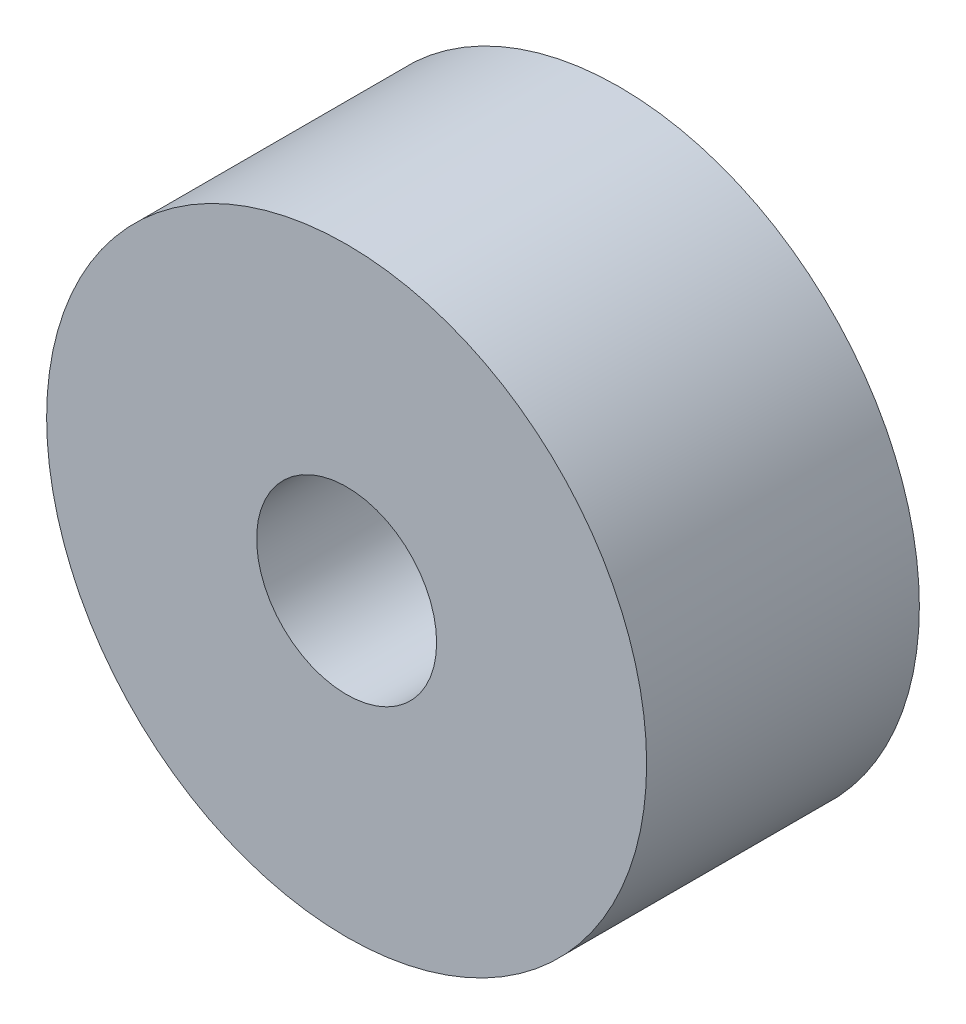
ISO-10303-21;
HEADER;
FILE_DESCRIPTION(('STEP AP214'),'2;1');
FILE_NAME('part.step','',(''),(''),'','','');
FILE_SCHEMA(('AUTOMOTIVE_DESIGN { 1 0 10303 214 1 1 1 1 }'));
ENDSEC;
DATA;
#1=APPLICATION_CONTEXT('core data for automotive mechanical design processes');
#2=APPLICATION_PROTOCOL_DEFINITION('international standard','automotive_design',2000,#1);
#3=PRODUCT_CONTEXT('',#1,'mechanical');
#4=PRODUCT('Part','Part','',(#3));
#5=PRODUCT_RELATED_PRODUCT_CATEGORY('part','',(#4));
#6=PRODUCT_DEFINITION_FORMATION('','',#4);
#7=PRODUCT_DEFINITION_CONTEXT('part definition',#1,'design');
#8=PRODUCT_DEFINITION('design','',#6,#7);
#9=PRODUCT_DEFINITION_SHAPE('','',#8);
#10=(LENGTH_UNIT() NAMED_UNIT(*) SI_UNIT(.MILLI.,.METRE.));
#11=(NAMED_UNIT(*) PLANE_ANGLE_UNIT() SI_UNIT($,.RADIAN.));
#12=(NAMED_UNIT(*) SI_UNIT($,.STERADIAN.) SOLID_ANGLE_UNIT());
#13=UNCERTAINTY_MEASURE_WITH_UNIT(LENGTH_MEASURE(1.E-05),#10,'distance_accuracy_value','');
#14=(GEOMETRIC_REPRESENTATION_CONTEXT(3) GLOBAL_UNCERTAINTY_ASSIGNED_CONTEXT((#13)) GLOBAL_UNIT_ASSIGNED_CONTEXT((#10,
#11,#12)) REPRESENTATION_CONTEXT('',''));
#15=CARTESIAN_POINT('',(0.,0.,0.));
#16=DIRECTION('',(0.,0.,1.));
#17=DIRECTION('',(1.,0.,0.));
#18=AXIS2_PLACEMENT_3D('',#15,#16,#17);
#19=CARTESIAN_POINT('',(0.,0.,2.5));
#20=DIRECTION('',(0.,0.,1.));
#21=DIRECTION('',(1.,0.,0.));
#22=AXIS2_PLACEMENT_3D('',#19,#20,#21);
#23=CYLINDRICAL_SURFACE('',#22,2.5);
#24=CARTESIAN_POINT('',(0.,0.,0.));
#25=DIRECTION('',(0.,0.,1.));
#26=DIRECTION('',(1.,0.,0.));
#27=AXIS2_PLACEMENT_3D('',#24,#25,#26);
#28=CIRCLE('',#27,2.5);
#29=CARTESIAN_POINT('',(2.5,0.,0.));
#30=VERTEX_POINT('',#29);
#31=EDGE_CURVE('E69',#30,#30,#28,.T.);
#32=ORIENTED_EDGE('',*,*,#31,.T.);
#33=EDGE_LOOP('',(#32));
#34=FACE_BOUND('',#33,.T.);
#35=CARTESIAN_POINT('',(0.,0.,-2.5));
#36=DIRECTION('',(0.,0.,1.));
#37=DIRECTION('',(1.,0.,0.));
#38=AXIS2_PLACEMENT_3D('',#35,#36,#37);
#39=CIRCLE('',#38,2.5);
#40=CARTESIAN_POINT('',(2.5,0.,-2.5));
#41=VERTEX_POINT('',#40);
#42=EDGE_CURVE('E10',#41,#41,#39,.T.);
#43=ORIENTED_EDGE('',*,*,#42,.F.);
#44=EDGE_LOOP('',(#43));
#45=FACE_BOUND('',#44,.T.);
#46=ADVANCED_FACE('F42',(#34,#45),#23,.F.);
#47=CARTESIAN_POINT('',(2.5,0.,-2.5));
#48=DIRECTION('',(0.,0.,-1.));
#49=DIRECTION('',(-1.,0.,0.));
#50=AXIS2_PLACEMENT_3D('',#47,#48,#49);
#51=PLANE('',#50);
#52=ORIENTED_EDGE('',*,*,#42,.T.);
#53=EDGE_LOOP('',(#52));
#54=FACE_BOUND('',#53,.T.);
#55=CARTESIAN_POINT('',(0.,0.,-2.5));
#56=DIRECTION('',(0.,0.,1.));
#57=DIRECTION('',(1.,0.,0.));
#58=AXIS2_PLACEMENT_3D('',#55,#56,#57);
#59=CIRCLE('',#58,5.5);
#60=CARTESIAN_POINT('',(5.5,0.,-2.5));
#61=VERTEX_POINT('',#60);
#62=EDGE_CURVE('E49',#61,#61,#59,.T.);
#63=ORIENTED_EDGE('',*,*,#62,.F.);
#64=EDGE_LOOP('',(#63));
#65=FACE_BOUND('',#64,.T.);
#66=ADVANCED_FACE('F88',(#54,#65),#51,.T.);
#67=CARTESIAN_POINT('',(0.,0.,2.5));
#68=DIRECTION('',(0.,0.,1.));
#69=DIRECTION('',(1.,0.,0.));
#70=AXIS2_PLACEMENT_3D('',#67,#68,#69);
#71=CYLINDRICAL_SURFACE('',#70,5.5);
#72=ORIENTED_EDGE('',*,*,#62,.T.);
#73=EDGE_LOOP('',(#72));
#74=FACE_BOUND('',#73,.T.);
#75=CARTESIAN_POINT('',(0.,0.,2.5));
#76=DIRECTION('',(0.,0.,1.));
#77=DIRECTION('',(1.,0.,0.));
#78=AXIS2_PLACEMENT_3D('',#75,#76,#77);
#79=CIRCLE('',#78,5.5);
#80=CARTESIAN_POINT('',(5.5,0.,2.5));
#81=VERTEX_POINT('',#80);
#82=EDGE_CURVE('E54',#81,#81,#79,.T.);
#83=ORIENTED_EDGE('',*,*,#82,.F.);
#84=EDGE_LOOP('',(#83));
#85=FACE_BOUND('',#84,.T.);
#86=ADVANCED_FACE('F92',(#74,#85),#71,.T.);
#87=CARTESIAN_POINT('',(5.5,0.,2.5));
#88=DIRECTION('',(0.,0.,1.));
#89=DIRECTION('',(1.,0.,0.));
#90=AXIS2_PLACEMENT_3D('',#87,#88,#89);
#91=PLANE('',#90);
#92=ORIENTED_EDGE('',*,*,#82,.T.);
#93=EDGE_LOOP('',(#92));
#94=FACE_BOUND('',#93,.T.);
#95=CARTESIAN_POINT('',(0.,0.,2.5));
#96=DIRECTION('',(0.,0.,1.));
#97=DIRECTION('',(1.,0.,0.));
#98=AXIS2_PLACEMENT_3D('',#95,#96,#97);
#99=CIRCLE('',#98,1.65);
#100=CARTESIAN_POINT('',(1.65,0.,2.5));
#101=VERTEX_POINT('',#100);
#102=EDGE_CURVE('E59',#101,#101,#99,.T.);
#103=ORIENTED_EDGE('',*,*,#102,.F.);
#104=EDGE_LOOP('',(#103));
#105=FACE_BOUND('',#104,.T.);
#106=ADVANCED_FACE('F84',(#94,#105),#91,.T.);
#107=CARTESIAN_POINT('',(0.,0.,2.5));
#108=DIRECTION('',(0.,0.,1.));
#109=DIRECTION('',(1.,0.,0.));
#110=AXIS2_PLACEMENT_3D('',#107,#108,#109);
#111=CYLINDRICAL_SURFACE('',#110,1.65);
#112=ORIENTED_EDGE('',*,*,#102,.T.);
#113=EDGE_LOOP('',(#112));
#114=FACE_BOUND('',#113,.T.);
#115=CARTESIAN_POINT('',(0.,0.,0.));
#116=DIRECTION('',(0.,0.,1.));
#117=DIRECTION('',(1.,0.,0.));
#118=AXIS2_PLACEMENT_3D('',#115,#116,#117);
#119=CIRCLE('',#118,1.65);
#120=CARTESIAN_POINT('',(1.65,0.,0.));
#121=VERTEX_POINT('',#120);
#122=EDGE_CURVE('E65',#121,#121,#119,.T.);
#123=ORIENTED_EDGE('',*,*,#122,.F.);
#124=EDGE_LOOP('',(#123));
#125=FACE_BOUND('',#124,.T.);
#126=ADVANCED_FACE('F78',(#114,#125),#111,.F.);
#127=CARTESIAN_POINT('',(1.65,0.,0.));
#128=DIRECTION('',(0.,0.,-1.));
#129=DIRECTION('',(-1.,0.,0.));
#130=AXIS2_PLACEMENT_3D('',#127,#128,#129);
#131=PLANE('',#130);
#132=ORIENTED_EDGE('',*,*,#122,.T.);
#133=EDGE_LOOP('',(#132));
#134=FACE_BOUND('',#133,.T.);
#135=ORIENTED_EDGE('',*,*,#31,.F.);
#136=EDGE_LOOP('',(#135));
#137=FACE_BOUND('',#136,.T.);
#138=ADVANCED_FACE('F76',(#134,#137),#131,.T.);
#139=CLOSED_SHELL('',(#46,#66,#86,#106,#126,#138));
#140=MANIFOLD_SOLID_BREP('B2',#139);
#141=ADVANCED_BREP_SHAPE_REPRESENTATION('',(#18,#140),#14);
#142=SHAPE_DEFINITION_REPRESENTATION(#9,#141);
ENDSEC;
END-ISO-10303-21;
